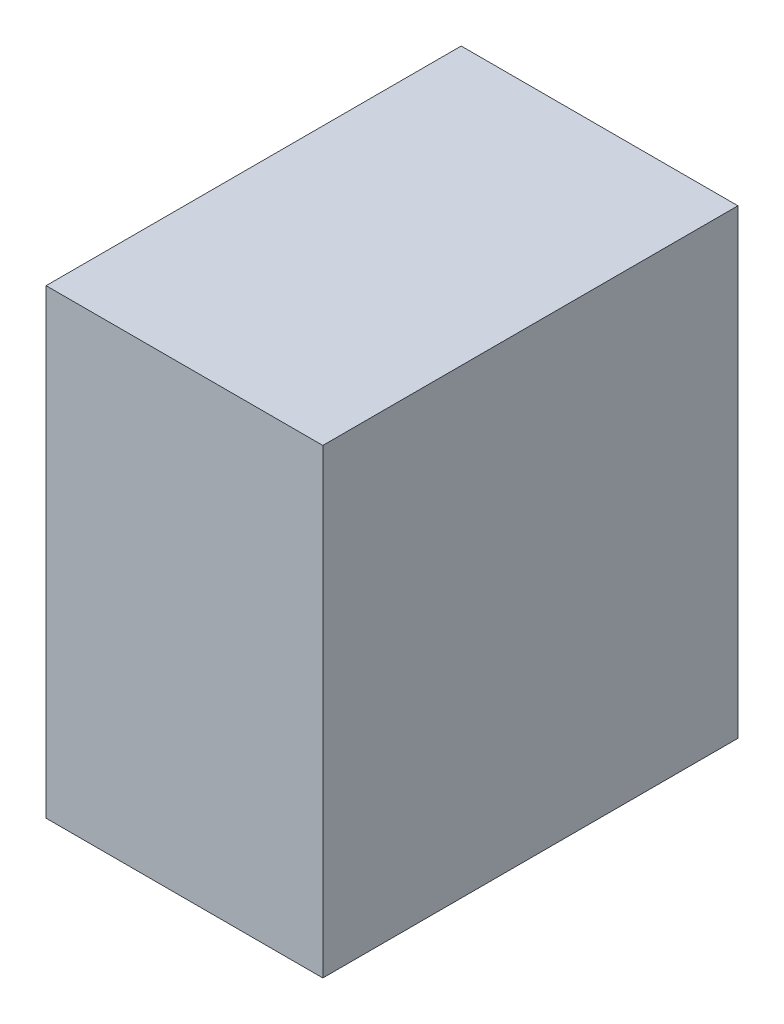
ISO-10303-21;
HEADER;
FILE_DESCRIPTION(('STEP AP214'),'2;1');
FILE_NAME('part.step','',(''),(''),'','','');
FILE_SCHEMA(('AUTOMOTIVE_DESIGN { 1 0 10303 214 1 1 1 1 }'));
ENDSEC;
DATA;
#1=APPLICATION_CONTEXT('core data for automotive mechanical design processes');
#2=APPLICATION_PROTOCOL_DEFINITION('international standard','automotive_design',2000,#1);
#3=PRODUCT_CONTEXT('',#1,'mechanical');
#4=PRODUCT('Part','Part','',(#3));
#5=PRODUCT_RELATED_PRODUCT_CATEGORY('part','',(#4));
#6=PRODUCT_DEFINITION_FORMATION('','',#4);
#7=PRODUCT_DEFINITION_CONTEXT('part definition',#1,'design');
#8=PRODUCT_DEFINITION('design','',#6,#7);
#9=PRODUCT_DEFINITION_SHAPE('','',#8);
#10=(LENGTH_UNIT() NAMED_UNIT(*) SI_UNIT(.MILLI.,.METRE.));
#11=(NAMED_UNIT(*) PLANE_ANGLE_UNIT() SI_UNIT($,.RADIAN.));
#12=(NAMED_UNIT(*) SI_UNIT($,.STERADIAN.) SOLID_ANGLE_UNIT());
#13=UNCERTAINTY_MEASURE_WITH_UNIT(LENGTH_MEASURE(1.E-05),#10,'distance_accuracy_value','');
#14=(GEOMETRIC_REPRESENTATION_CONTEXT(3) GLOBAL_UNCERTAINTY_ASSIGNED_CONTEXT((#13)) GLOBAL_UNIT_ASSIGNED_CONTEXT((#10,
#11,#12)) REPRESENTATION_CONTEXT('',''));
#15=CARTESIAN_POINT('',(0.,0.,0.));
#16=DIRECTION('',(0.,0.,1.));
#17=DIRECTION('',(1.,0.,0.));
#18=AXIS2_PLACEMENT_3D('',#15,#16,#17);
#19=CARTESIAN_POINT('',(3.29999968527797,-1.80000079117613,-3.30112167835709));
#20=DIRECTION('',(1.,-1.74845553146952E-07,0.));
#21=DIRECTION('',(1.74845553146952E-07,1.,8.74227765734759E-08));
#22=AXIS2_PLACEMENT_3D('',#19,#20,#21);
#23=PLANE('',#22);
#24=DIRECTION('',(1.74845553146599E-07,0.999999999999981,8.74227765732993E-08));
#25=VECTOR('',#24,1.);
#26=CARTESIAN_POINT('',(3.29999969402024,-1.75000079554727,-3.25112167398595));
#27=LINE('',#26,#25);
#28=CARTESIAN_POINT('',(3.29999969402124,-1.75000079554627,-3.25112167398595));
#29=VERTEX_POINT('',#28);
#30=CARTESIAN_POINT('',(3.2999998688668,-0.750000795545267,-3.25112158656218));
#31=VERTEX_POINT('',#30);
#32=EDGE_CURVE('E11',#29,#31,#27,.T.);
#33=ORIENTED_EDGE('',*,*,#32,.F.);
#34=DIRECTION('',(0.,8.7422776672162E-08,-0.999999999999996));
#35=VECTOR('',#34,1.);
#36=CARTESIAN_POINT('',(3.29999969402023,-1.75000087422777,-2.35112167398595));
#37=LINE('',#36,#35);
#38=CARTESIAN_POINT('',(3.29999969402123,-1.75000087422777,-2.35112167398695));
#39=VERTEX_POINT('',#38);
#40=EDGE_CURVE('E59',#39,#29,#37,.T.);
#41=ORIENTED_EDGE('',*,*,#40,.F.);
#42=DIRECTION('',(-1.74845553146599E-07,-0.999999999999981,-8.74227765732994E-08));
#43=VECTOR('',#42,1.);
#44=CARTESIAN_POINT('',(3.29999986886578,-0.750000874225766,-2.35112158656318));
#45=LINE('',#44,#43);
#46=CARTESIAN_POINT('',(3.29999986886678,-0.750000874226766,-2.35112158656318));
#47=VERTEX_POINT('',#46);
#48=EDGE_CURVE('E79',#47,#39,#45,.T.);
#49=ORIENTED_EDGE('',*,*,#48,.F.);
#50=DIRECTION('',(0.,-8.74227765488039E-08,0.999999999999996));
#51=VECTOR('',#50,1.);
#52=CARTESIAN_POINT('',(3.2999998688658,-0.750000795545267,-3.25112158656318));
#53=LINE('',#52,#51);
#54=EDGE_CURVE('E84',#31,#47,#53,.T.);
#55=ORIENTED_EDGE('',*,*,#54,.F.);
#56=EDGE_LOOP('',(#33,#41,#49,#55));
#57=FACE_BOUND('',#56,.T.);
#58=ADVANCED_FACE('F17',(#57),#23,.F.);
#59=CARTESIAN_POINT('',(3.89999968527797,-1.80000089608346,-3.30112167835709));
#60=DIRECTION('',(1.,-1.74845553146952E-07,0.));
#61=DIRECTION('',(1.74845553146952E-07,1.,8.74227765734759E-08));
#62=AXIS2_PLACEMENT_3D('',#59,#60,#61);
#63=PLANE('',#62);
#64=DIRECTION('',(0.,-8.74227771655945E-08,0.999999999999996));
#65=VECTOR('',#64,1.);
#66=CARTESIAN_POINT('',(3.8999998688658,-0.750000900452598,-3.25112158656318));
#67=LINE('',#66,#65);
#68=CARTESIAN_POINT('',(3.8999998688648,-0.750000900452599,-3.25112158656218));
#69=VERTEX_POINT('',#68);
#70=CARTESIAN_POINT('',(3.89999986886478,-0.750000979134098,-2.35112158656318));
#71=VERTEX_POINT('',#70);
#72=EDGE_CURVE('E24',#69,#71,#67,.T.);
#73=ORIENTED_EDGE('',*,*,#72,.T.);
#74=DIRECTION('',(-1.74845553146599E-07,-0.999999999999981,-8.74227765732993E-08));
#75=VECTOR('',#74,1.);
#76=CARTESIAN_POINT('',(3.89999986886578,-0.750000979133097,-2.35112158656318));
#77=LINE('',#76,#75);
#78=CARTESIAN_POINT('',(3.89999969401923,-1.7500009791351,-2.35112167398695));
#79=VERTEX_POINT('',#78);
#80=EDGE_CURVE('E82',#71,#79,#77,.T.);
#81=ORIENTED_EDGE('',*,*,#80,.T.);
#82=DIRECTION('',(0.,8.7422776672162E-08,-0.999999999999996));
#83=VECTOR('',#82,1.);
#84=CARTESIAN_POINT('',(3.89999969402023,-1.7500009791351,-2.35112167398595));
#85=LINE('',#84,#83);
#86=CARTESIAN_POINT('',(3.89999969401924,-1.7500009004536,-3.25112167398595));
#87=VERTEX_POINT('',#86);
#88=EDGE_CURVE('E64',#79,#87,#85,.T.);
#89=ORIENTED_EDGE('',*,*,#88,.T.);
#90=DIRECTION('',(1.74845553146599E-07,0.999999999999981,8.74227765732993E-08));
#91=VECTOR('',#90,1.);
#92=CARTESIAN_POINT('',(3.89999969402024,-1.7500009004546,-3.25112167398595));
#93=LINE('',#92,#91);
#94=EDGE_CURVE('E61',#87,#69,#93,.T.);
#95=ORIENTED_EDGE('',*,*,#94,.T.);
#96=EDGE_LOOP('',(#73,#81,#89,#95));
#97=FACE_BOUND('',#96,.T.);
#98=ADVANCED_FACE('F62',(#97),#63,.T.);
#99=CARTESIAN_POINT('',(3.2999998688658,-0.750000795545267,-3.25112158656318));
#100=DIRECTION('',(1.74845553146952E-07,1.,8.74227765734759E-08));
#101=DIRECTION('',(0.,-8.74227765734759E-08,1.));
#102=AXIS2_PLACEMENT_3D('',#99,#100,#101);
#103=PLANE('',#102);
#104=ORIENTED_EDGE('',*,*,#54,.T.);
#105=DIRECTION('',(0.999999999999985,-1.74845553220964E-07,0.));
#106=VECTOR('',#105,1.);
#107=CARTESIAN_POINT('',(3.29999986886578,-0.750000874225766,-2.35112158656318));
#108=LINE('',#107,#106);
#109=EDGE_CURVE('E57',#47,#71,#108,.T.);
#110=ORIENTED_EDGE('',*,*,#109,.T.);
#111=ORIENTED_EDGE('',*,*,#72,.F.);
#112=DIRECTION('',(0.999999999999985,-1.74845553220964E-07,0.));
#113=VECTOR('',#112,1.);
#114=CARTESIAN_POINT('',(3.2999998688658,-0.750000795545267,-3.25112158656318));
#115=LINE('',#114,#113);
#116=EDGE_CURVE('E55',#31,#69,#115,.T.);
#117=ORIENTED_EDGE('',*,*,#116,.F.);
#118=EDGE_LOOP('',(#104,#110,#111,#117));
#119=FACE_BOUND('',#118,.T.);
#120=ADVANCED_FACE('F53',(#119),#103,.T.);
#121=CARTESIAN_POINT('',(3.29999986886578,-0.750000874225766,-2.35112158656318));
#122=DIRECTION('',(0.,-8.74227765734759E-08,1.));
#123=DIRECTION('',(-1.74845553146952E-07,-1.,-8.74227765734759E-08));
#124=AXIS2_PLACEMENT_3D('',#121,#122,#123);
#125=PLANE('',#124);
#126=ORIENTED_EDGE('',*,*,#48,.T.);
#127=DIRECTION('',(0.999999999999985,-1.74845553220964E-07,0.));
#128=VECTOR('',#127,1.);
#129=CARTESIAN_POINT('',(3.29999969402023,-1.75000087422777,-2.35112167398595));
#130=LINE('',#129,#128);
#131=EDGE_CURVE('E68',#39,#79,#130,.T.);
#132=ORIENTED_EDGE('',*,*,#131,.T.);
#133=ORIENTED_EDGE('',*,*,#80,.F.);
#134=ORIENTED_EDGE('',*,*,#109,.F.);
#135=EDGE_LOOP('',(#126,#132,#133,#134));
#136=FACE_BOUND('',#135,.T.);
#137=ADVANCED_FACE('F91',(#136),#125,.T.);
#138=CARTESIAN_POINT('',(3.29999969402023,-1.75000087422777,-2.35112167398595));
#139=DIRECTION('',(-1.74845553146952E-07,-1.,-8.74227765734759E-08));
#140=DIRECTION('',(0.,8.74227765734759E-08,-1.));
#141=AXIS2_PLACEMENT_3D('',#138,#139,#140);
#142=PLANE('',#141);
#143=ORIENTED_EDGE('',*,*,#40,.T.);
#144=DIRECTION('',(0.999999999999985,-1.74845553220964E-07,0.));
#145=VECTOR('',#144,1.);
#146=CARTESIAN_POINT('',(3.29999969402024,-1.75000079554727,-3.25112167398595));
#147=LINE('',#146,#145);
#148=EDGE_CURVE('E69',#29,#87,#147,.T.);
#149=ORIENTED_EDGE('',*,*,#148,.T.);
#150=ORIENTED_EDGE('',*,*,#88,.F.);
#151=ORIENTED_EDGE('',*,*,#131,.F.);
#152=EDGE_LOOP('',(#143,#149,#150,#151));
#153=FACE_BOUND('',#152,.T.);
#154=ADVANCED_FACE('F88',(#153),#142,.T.);
#155=CARTESIAN_POINT('',(3.29999969402024,-1.75000079554727,-3.25112167398595));
#156=DIRECTION('',(0.,8.74227765734759E-08,-1.));
#157=DIRECTION('',(1.74845553146952E-07,1.,8.74227765734759E-08));
#158=AXIS2_PLACEMENT_3D('',#155,#156,#157);
#159=PLANE('',#158);
#160=ORIENTED_EDGE('',*,*,#32,.T.);
#161=ORIENTED_EDGE('',*,*,#116,.T.);
#162=ORIENTED_EDGE('',*,*,#94,.F.);
#163=ORIENTED_EDGE('',*,*,#148,.F.);
#164=EDGE_LOOP('',(#160,#161,#162,#163));
#165=FACE_BOUND('',#164,.T.);
#166=ADVANCED_FACE('F71',(#165),#159,.T.);
#167=CLOSED_SHELL('',(#58,#98,#120,#137,#154,#166));
#168=MANIFOLD_SOLID_BREP('B1',#167);
#169=ADVANCED_BREP_SHAPE_REPRESENTATION('',(#18,#168),#14);
#170=SHAPE_DEFINITION_REPRESENTATION(#9,#169);
ENDSEC;
END-ISO-10303-21;
